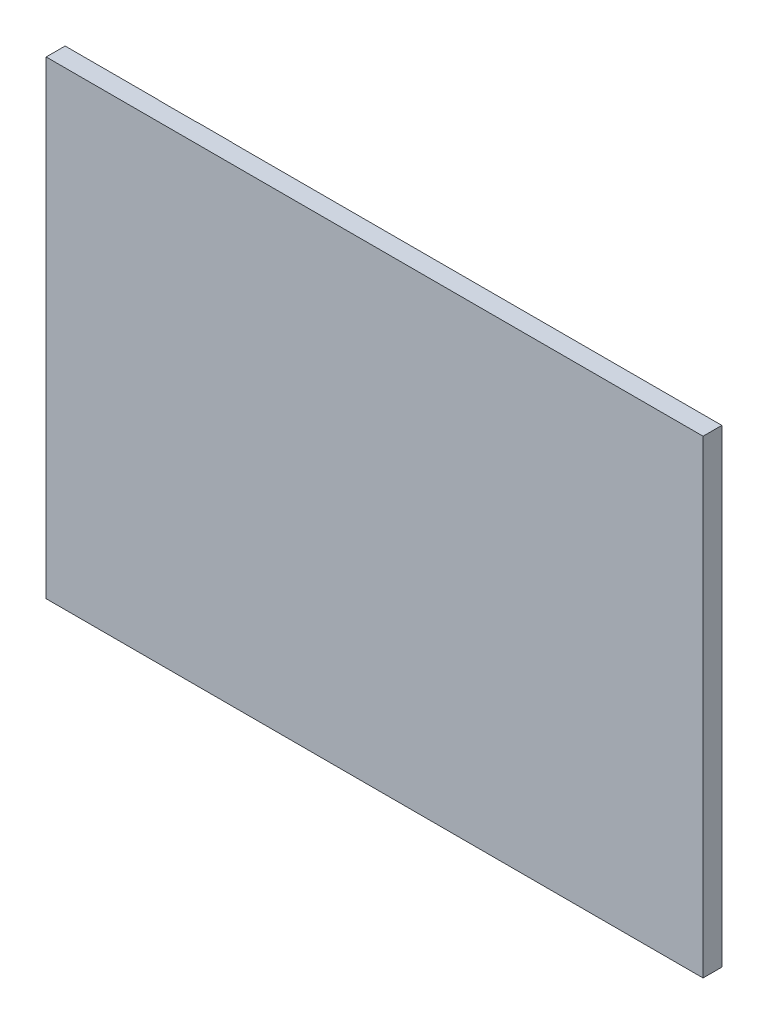
ISO-10303-21;
HEADER;
FILE_DESCRIPTION(('STEP AP214'),'2;1');
FILE_NAME('part.step','',(''),(''),'','','');
FILE_SCHEMA(('AUTOMOTIVE_DESIGN { 1 0 10303 214 1 1 1 1 }'));
ENDSEC;
DATA;
#1=APPLICATION_CONTEXT('core data for automotive mechanical design processes');
#2=APPLICATION_PROTOCOL_DEFINITION('international standard','automotive_design',2000,#1);
#3=PRODUCT_CONTEXT('',#1,'mechanical');
#4=PRODUCT('Part','Part','',(#3));
#5=PRODUCT_RELATED_PRODUCT_CATEGORY('part','',(#4));
#6=PRODUCT_DEFINITION_FORMATION('','',#4);
#7=PRODUCT_DEFINITION_CONTEXT('part definition',#1,'design');
#8=PRODUCT_DEFINITION('design','',#6,#7);
#9=PRODUCT_DEFINITION_SHAPE('','',#8);
#10=(LENGTH_UNIT() NAMED_UNIT(*) SI_UNIT(.MILLI.,.METRE.));
#11=(NAMED_UNIT(*) PLANE_ANGLE_UNIT() SI_UNIT($,.RADIAN.));
#12=(NAMED_UNIT(*) SI_UNIT($,.STERADIAN.) SOLID_ANGLE_UNIT());
#13=UNCERTAINTY_MEASURE_WITH_UNIT(LENGTH_MEASURE(1.E-05),#10,'distance_accuracy_value','');
#14=(GEOMETRIC_REPRESENTATION_CONTEXT(3) GLOBAL_UNCERTAINTY_ASSIGNED_CONTEXT((#13)) GLOBAL_UNIT_ASSIGNED_CONTEXT((#10,
#11,#12)) REPRESENTATION_CONTEXT('',''));
#15=CARTESIAN_POINT('',(0.,0.,0.));
#16=DIRECTION('',(0.,0.,1.));
#17=DIRECTION('',(1.,0.,0.));
#18=AXIS2_PLACEMENT_3D('',#15,#16,#17);
#19=CARTESIAN_POINT('',(0.,0.,0.));
#20=DIRECTION('',(0.,0.,1.));
#21=DIRECTION('',(1.,0.,0.));
#22=AXIS2_PLACEMENT_3D('',#19,#20,#21);
#23=PLANE('',#22);
#24=DIRECTION('',(0.,1.,0.));
#25=VECTOR('',#24,1.);
#26=CARTESIAN_POINT('',(-105.,-125.,0.));
#27=LINE('',#26,#25);
#28=CARTESIAN_POINT('',(-105.,-125.,0.));
#29=VERTEX_POINT('',#28);
#30=CARTESIAN_POINT('',(-105.,125.,0.));
#31=VERTEX_POINT('',#30);
#32=EDGE_CURVE('E133',#29,#31,#27,.T.);
#33=ORIENTED_EDGE('',*,*,#32,.F.);
#34=DIRECTION('',(1.,0.,0.));
#35=VECTOR('',#34,1.);
#36=CARTESIAN_POINT('',(-175.,-125.,0.));
#37=LINE('',#36,#35);
#38=CARTESIAN_POINT('',(-125.,-125.,0.));
#39=VERTEX_POINT('',#38);
#40=EDGE_CURVE('E162',#39,#29,#37,.T.);
#41=ORIENTED_EDGE('',*,*,#40,.F.);
#42=DIRECTION('',(0.,-1.,0.));
#43=VECTOR('',#42,1.);
#44=CARTESIAN_POINT('',(-125.,-125.,0.));
#45=LINE('',#44,#43);
#46=CARTESIAN_POINT('',(-125.,125.,0.));
#47=VERTEX_POINT('',#46);
#48=EDGE_CURVE('E134',#47,#39,#45,.T.);
#49=ORIENTED_EDGE('',*,*,#48,.F.);
#50=DIRECTION('',(-1.,0.,0.));
#51=VECTOR('',#50,1.);
#52=CARTESIAN_POINT('',(-175.,125.,0.));
#53=LINE('',#52,#51);
#54=EDGE_CURVE('E57',#31,#47,#53,.T.);
#55=ORIENTED_EDGE('',*,*,#54,.F.);
#56=EDGE_LOOP('',(#33,#41,#49,#55));
#57=FACE_BOUND('',#56,.T.);
#58=ADVANCED_FACE('F34',(#57),#23,.F.);
#59=DIRECTION('',(0.,-1.,0.));
#60=VECTOR('',#59,1.);
#61=CARTESIAN_POINT('',(-85.9999999999999,-125.,0.));
#62=LINE('',#61,#60);
#63=CARTESIAN_POINT('',(-86.,125.,0.));
#64=VERTEX_POINT('',#63);
#65=CARTESIAN_POINT('',(-85.9999999999999,-125.,0.));
#66=VERTEX_POINT('',#65);
#67=EDGE_CURVE('E129',#64,#66,#62,.T.);
#68=ORIENTED_EDGE('',*,*,#67,.F.);
#69=CARTESIAN_POINT('',(175.,125.,0.));
#70=VERTEX_POINT('',#69);
#71=EDGE_CURVE('E171',#70,#64,#53,.T.);
#72=ORIENTED_EDGE('',*,*,#71,.F.);
#73=DIRECTION('',(0.,1.,0.));
#74=VECTOR('',#73,1.);
#75=CARTESIAN_POINT('',(175.,125.,0.));
#76=LINE('',#75,#74);
#77=CARTESIAN_POINT('',(175.,-125.,0.));
#78=VERTEX_POINT('',#77);
#79=EDGE_CURVE('E157',#78,#70,#76,.T.);
#80=ORIENTED_EDGE('',*,*,#79,.F.);
#81=EDGE_CURVE('E173',#66,#78,#37,.T.);
#82=ORIENTED_EDGE('',*,*,#81,.F.);
#83=EDGE_LOOP('',(#68,#72,#80,#82));
#84=FACE_BOUND('',#83,.T.);
#85=ADVANCED_FACE('F203',(#84),#23,.F.);
#86=CARTESIAN_POINT('',(175.,125.,10.));
#87=DIRECTION('',(-1.,0.,0.));
#88=DIRECTION('',(0.,0.,1.));
#89=AXIS2_PLACEMENT_3D('',#86,#87,#88);
#90=PLANE('',#89);
#91=ORIENTED_EDGE('',*,*,#79,.T.);
#92=DIRECTION('',(0.,0.,-1.));
#93=VECTOR('',#92,1.);
#94=CARTESIAN_POINT('',(175.,125.,10.));
#95=LINE('',#94,#93);
#96=CARTESIAN_POINT('',(175.,125.,10.));
#97=VERTEX_POINT('',#96);
#98=EDGE_CURVE('E11',#97,#70,#95,.T.);
#99=ORIENTED_EDGE('',*,*,#98,.F.);
#100=DIRECTION('',(0.,1.,0.));
#101=VECTOR('',#100,1.);
#102=CARTESIAN_POINT('',(175.,125.,10.));
#103=LINE('',#102,#101);
#104=CARTESIAN_POINT('',(175.,-125.,10.));
#105=VERTEX_POINT('',#104);
#106=EDGE_CURVE('E158',#105,#97,#103,.T.);
#107=ORIENTED_EDGE('',*,*,#106,.F.);
#108=DIRECTION('',(0.,0.,-1.));
#109=VECTOR('',#108,1.);
#110=CARTESIAN_POINT('',(175.,-125.,10.));
#111=LINE('',#110,#109);
#112=EDGE_CURVE('E168',#105,#78,#111,.T.);
#113=ORIENTED_EDGE('',*,*,#112,.T.);
#114=EDGE_LOOP('',(#91,#99,#107,#113));
#115=FACE_BOUND('',#114,.T.);
#116=ADVANCED_FACE('F36',(#115),#90,.F.);
#117=CARTESIAN_POINT('',(-175.,125.,10.));
#118=DIRECTION('',(0.,-1.,0.));
#119=DIRECTION('',(0.,0.,-1.));
#120=AXIS2_PLACEMENT_3D('',#117,#118,#119);
#121=PLANE('',#120);
#122=ORIENTED_EDGE('',*,*,#71,.T.);
#123=DIRECTION('',(0.,0.,1.));
#124=VECTOR('',#123,1.);
#125=CARTESIAN_POINT('',(-86.,125.,-0.1));
#126=LINE('',#125,#124);
#127=CARTESIAN_POINT('',(-86.,125.,-0.1));
#128=VERTEX_POINT('',#127);
#129=EDGE_CURVE('E118',#128,#64,#126,.T.);
#130=ORIENTED_EDGE('',*,*,#129,.F.);
#131=DIRECTION('',(1.,0.,0.));
#132=VECTOR('',#131,1.);
#133=CARTESIAN_POINT('',(-105.,125.,-0.1));
#134=LINE('',#133,#132);
#135=CARTESIAN_POINT('',(-105.,125.,-0.1));
#136=VERTEX_POINT('',#135);
#137=EDGE_CURVE('E111',#136,#128,#134,.T.);
#138=ORIENTED_EDGE('',*,*,#137,.F.);
#139=DIRECTION('',(0.,0.,1.));
#140=VECTOR('',#139,1.);
#141=CARTESIAN_POINT('',(-105.,125.,-0.1));
#142=LINE('',#141,#140);
#143=EDGE_CURVE('E116',#136,#31,#142,.T.);
#144=ORIENTED_EDGE('',*,*,#143,.T.);
#145=ORIENTED_EDGE('',*,*,#54,.T.);
#146=DIRECTION('',(0.,0.,1.));
#147=VECTOR('',#146,1.);
#148=CARTESIAN_POINT('',(-125.,125.,-0.1));
#149=LINE('',#148,#147);
#150=CARTESIAN_POINT('',(-125.,125.,-0.1));
#151=VERTEX_POINT('',#150);
#152=EDGE_CURVE('E154',#151,#47,#149,.T.);
#153=ORIENTED_EDGE('',*,*,#152,.F.);
#154=DIRECTION('',(1.,0.,0.));
#155=VECTOR('',#154,1.);
#156=CARTESIAN_POINT('',(-175.,125.,-0.1));
#157=LINE('',#156,#155);
#158=CARTESIAN_POINT('',(-175.,125.,-0.1));
#159=VERTEX_POINT('',#158);
#160=EDGE_CURVE('E144',#159,#151,#157,.T.);
#161=ORIENTED_EDGE('',*,*,#160,.F.);
#162=DIRECTION('',(0.,0.,-1.));
#163=VECTOR('',#162,1.);
#164=CARTESIAN_POINT('',(-175.,125.,10.));
#165=LINE('',#164,#163);
#166=CARTESIAN_POINT('',(-175.,125.,10.));
#167=VERTEX_POINT('',#166);
#168=EDGE_CURVE('E42',#167,#159,#165,.T.);
#169=ORIENTED_EDGE('',*,*,#168,.F.);
#170=DIRECTION('',(-1.,0.,0.));
#171=VECTOR('',#170,1.);
#172=CARTESIAN_POINT('',(-175.,125.,10.));
#173=LINE('',#172,#171);
#174=EDGE_CURVE('E161',#97,#167,#173,.T.);
#175=ORIENTED_EDGE('',*,*,#174,.F.);
#176=ORIENTED_EDGE('',*,*,#98,.T.);
#177=EDGE_LOOP('',(#122,#130,#138,#144,#145,#153,#161,#169,#175,#176));
#178=FACE_BOUND('',#177,.T.);
#179=ADVANCED_FACE('F114',(#178),#121,.F.);
#180=CARTESIAN_POINT('',(-175.,125.,10.));
#181=DIRECTION('',(1.,0.,0.));
#182=DIRECTION('',(0.,1.,0.));
#183=AXIS2_PLACEMENT_3D('',#180,#181,#182);
#184=PLANE('',#183);
#185=ORIENTED_EDGE('',*,*,#168,.T.);
#186=DIRECTION('',(0.,1.,0.));
#187=VECTOR('',#186,1.);
#188=CARTESIAN_POINT('',(-175.,-125.,-0.1));
#189=LINE('',#188,#187);
#190=CARTESIAN_POINT('',(-175.,-125.,-0.1));
#191=VERTEX_POINT('',#190);
#192=EDGE_CURVE('E137',#191,#159,#189,.T.);
#193=ORIENTED_EDGE('',*,*,#192,.F.);
#194=DIRECTION('',(0.,0.,-1.));
#195=VECTOR('',#194,1.);
#196=CARTESIAN_POINT('',(-175.,-125.,10.));
#197=LINE('',#196,#195);
#198=CARTESIAN_POINT('',(-175.,-125.,10.));
#199=VERTEX_POINT('',#198);
#200=EDGE_CURVE('E178',#199,#191,#197,.T.);
#201=ORIENTED_EDGE('',*,*,#200,.F.);
#202=DIRECTION('',(0.,-1.,0.));
#203=VECTOR('',#202,1.);
#204=CARTESIAN_POINT('',(-175.,125.,10.));
#205=LINE('',#204,#203);
#206=EDGE_CURVE('E164',#167,#199,#205,.T.);
#207=ORIENTED_EDGE('',*,*,#206,.F.);
#208=EDGE_LOOP('',(#185,#193,#201,#207));
#209=FACE_BOUND('',#208,.T.);
#210=ADVANCED_FACE('F184',(#209),#184,.F.);
#211=CARTESIAN_POINT('',(-175.,-125.,10.));
#212=DIRECTION('',(0.,1.,0.));
#213=DIRECTION('',(0.,0.,1.));
#214=AXIS2_PLACEMENT_3D('',#211,#212,#213);
#215=PLANE('',#214);
#216=ORIENTED_EDGE('',*,*,#200,.T.);
#217=DIRECTION('',(-1.,0.,0.));
#218=VECTOR('',#217,1.);
#219=CARTESIAN_POINT('',(-175.,-125.,-0.1));
#220=LINE('',#219,#218);
#221=CARTESIAN_POINT('',(-125.,-125.,-0.1));
#222=VERTEX_POINT('',#221);
#223=EDGE_CURVE('E148',#222,#191,#220,.T.);
#224=ORIENTED_EDGE('',*,*,#223,.F.);
#225=DIRECTION('',(0.,0.,1.));
#226=VECTOR('',#225,1.);
#227=CARTESIAN_POINT('',(-125.,-125.,-0.1));
#228=LINE('',#227,#226);
#229=EDGE_CURVE('E150',#222,#39,#228,.T.);
#230=ORIENTED_EDGE('',*,*,#229,.T.);
#231=ORIENTED_EDGE('',*,*,#40,.T.);
#232=DIRECTION('',(0.,0.,1.));
#233=VECTOR('',#232,1.);
#234=CARTESIAN_POINT('',(-105.,-125.,-0.1));
#235=LINE('',#234,#233);
#236=CARTESIAN_POINT('',(-105.,-125.,-0.1));
#237=VERTEX_POINT('',#236);
#238=EDGE_CURVE('E209',#237,#29,#235,.T.);
#239=ORIENTED_EDGE('',*,*,#238,.F.);
#240=DIRECTION('',(-1.,0.,0.));
#241=VECTOR('',#240,1.);
#242=CARTESIAN_POINT('',(-105.,-125.,-0.1));
#243=LINE('',#242,#241);
#244=CARTESIAN_POINT('',(-85.9999999999999,-125.,-0.1));
#245=VERTEX_POINT('',#244);
#246=EDGE_CURVE('E126',#245,#237,#243,.T.);
#247=ORIENTED_EDGE('',*,*,#246,.F.);
#248=DIRECTION('',(0.,0.,1.));
#249=VECTOR('',#248,1.);
#250=CARTESIAN_POINT('',(-85.9999999999999,-125.,-0.1));
#251=LINE('',#250,#249);
#252=EDGE_CURVE('E49',#245,#66,#251,.T.);
#253=ORIENTED_EDGE('',*,*,#252,.T.);
#254=ORIENTED_EDGE('',*,*,#81,.T.);
#255=ORIENTED_EDGE('',*,*,#112,.F.);
#256=DIRECTION('',(1.,0.,0.));
#257=VECTOR('',#256,1.);
#258=CARTESIAN_POINT('',(-175.,-125.,10.));
#259=LINE('',#258,#257);
#260=EDGE_CURVE('E166',#199,#105,#259,.T.);
#261=ORIENTED_EDGE('',*,*,#260,.F.);
#262=EDGE_LOOP('',(#216,#224,#230,#231,#239,#247,#253,#254,#255,#261));
#263=FACE_BOUND('',#262,.T.);
#264=ADVANCED_FACE('F191',(#263),#215,.F.);
#265=CARTESIAN_POINT('',(0.,0.,10.));
#266=DIRECTION('',(0.,0.,1.));
#267=DIRECTION('',(1.,0.,0.));
#268=AXIS2_PLACEMENT_3D('',#265,#266,#267);
#269=PLANE('',#268);
#270=ORIENTED_EDGE('',*,*,#106,.T.);
#271=ORIENTED_EDGE('',*,*,#174,.T.);
#272=ORIENTED_EDGE('',*,*,#206,.T.);
#273=ORIENTED_EDGE('',*,*,#260,.T.);
#274=EDGE_LOOP('',(#270,#271,#272,#273));
#275=FACE_BOUND('',#274,.T.);
#276=ADVANCED_FACE('F196',(#275),#269,.T.);
#277=CARTESIAN_POINT('',(-125.,-125.,-0.1));
#278=DIRECTION('',(-1.,0.,0.));
#279=DIRECTION('',(0.,-1.,0.));
#280=AXIS2_PLACEMENT_3D('',#277,#278,#279);
#281=PLANE('',#280);
#282=ORIENTED_EDGE('',*,*,#48,.T.);
#283=ORIENTED_EDGE('',*,*,#229,.F.);
#284=DIRECTION('',(0.,-1.,0.));
#285=VECTOR('',#284,1.);
#286=CARTESIAN_POINT('',(-125.,-125.,-0.1));
#287=LINE('',#286,#285);
#288=EDGE_CURVE('E146',#151,#222,#287,.T.);
#289=ORIENTED_EDGE('',*,*,#288,.F.);
#290=ORIENTED_EDGE('',*,*,#152,.T.);
#291=EDGE_LOOP('',(#282,#283,#289,#290));
#292=FACE_BOUND('',#291,.T.);
#293=ADVANCED_FACE('F214',(#292),#281,.F.);
#294=CARTESIAN_POINT('',(0.,0.,-0.1));
#295=DIRECTION('',(0.,0.,-1.));
#296=DIRECTION('',(-1.,0.,0.));
#297=AXIS2_PLACEMENT_3D('',#294,#295,#296);
#298=PLANE('',#297);
#299=ORIENTED_EDGE('',*,*,#192,.T.);
#300=ORIENTED_EDGE('',*,*,#160,.T.);
#301=ORIENTED_EDGE('',*,*,#288,.T.);
#302=ORIENTED_EDGE('',*,*,#223,.T.);
#303=EDGE_LOOP('',(#299,#300,#301,#302));
#304=FACE_BOUND('',#303,.T.);
#305=ADVANCED_FACE('F188',(#304),#298,.T.);
#306=CARTESIAN_POINT('',(-105.,-125.,-0.1));
#307=DIRECTION('',(1.,0.,0.));
#308=DIRECTION('',(0.,1.,0.));
#309=AXIS2_PLACEMENT_3D('',#306,#307,#308);
#310=PLANE('',#309);
#311=ORIENTED_EDGE('',*,*,#32,.T.);
#312=ORIENTED_EDGE('',*,*,#143,.F.);
#313=DIRECTION('',(0.,1.,0.));
#314=VECTOR('',#313,1.);
#315=CARTESIAN_POINT('',(-105.,-125.,-0.1));
#316=LINE('',#315,#314);
#317=EDGE_CURVE('E122',#237,#136,#316,.T.);
#318=ORIENTED_EDGE('',*,*,#317,.F.);
#319=ORIENTED_EDGE('',*,*,#238,.T.);
#320=EDGE_LOOP('',(#311,#312,#318,#319));
#321=FACE_BOUND('',#320,.T.);
#322=ADVANCED_FACE('F131',(#321),#310,.F.);
#323=CARTESIAN_POINT('',(-85.9999999999999,-125.,-0.1));
#324=DIRECTION('',(-1.,0.,0.));
#325=DIRECTION('',(0.,-1.,0.));
#326=AXIS2_PLACEMENT_3D('',#323,#324,#325);
#327=PLANE('',#326);
#328=ORIENTED_EDGE('',*,*,#67,.T.);
#329=ORIENTED_EDGE('',*,*,#252,.F.);
#330=DIRECTION('',(0.,-1.,0.));
#331=VECTOR('',#330,1.);
#332=CARTESIAN_POINT('',(-85.9999999999999,-125.,-0.1));
#333=LINE('',#332,#331);
#334=EDGE_CURVE('E121',#128,#245,#333,.T.);
#335=ORIENTED_EDGE('',*,*,#334,.F.);
#336=ORIENTED_EDGE('',*,*,#129,.T.);
#337=EDGE_LOOP('',(#328,#329,#335,#336));
#338=FACE_BOUND('',#337,.T.);
#339=ADVANCED_FACE('F211',(#338),#327,.F.);
#340=CARTESIAN_POINT('',(0.,0.,-0.1));
#341=DIRECTION('',(0.,0.,-1.));
#342=DIRECTION('',(-1.,0.,0.));
#343=AXIS2_PLACEMENT_3D('',#340,#341,#342);
#344=PLANE('',#343);
#345=ORIENTED_EDGE('',*,*,#317,.T.);
#346=ORIENTED_EDGE('',*,*,#137,.T.);
#347=ORIENTED_EDGE('',*,*,#334,.T.);
#348=ORIENTED_EDGE('',*,*,#246,.T.);
#349=EDGE_LOOP('',(#345,#346,#347,#348));
#350=FACE_BOUND('',#349,.T.);
#351=ADVANCED_FACE('F125',(#350),#344,.T.);
#352=CLOSED_SHELL('',(#58,#85,#116,#179,#210,#264,#276,#293,#305,#322,#339,#351));
#353=MANIFOLD_SOLID_BREP('B2',#352);
#354=ADVANCED_BREP_SHAPE_REPRESENTATION('',(#18,#353),#14);
#355=SHAPE_DEFINITION_REPRESENTATION(#9,#354);
ENDSEC;
END-ISO-10303-21;
